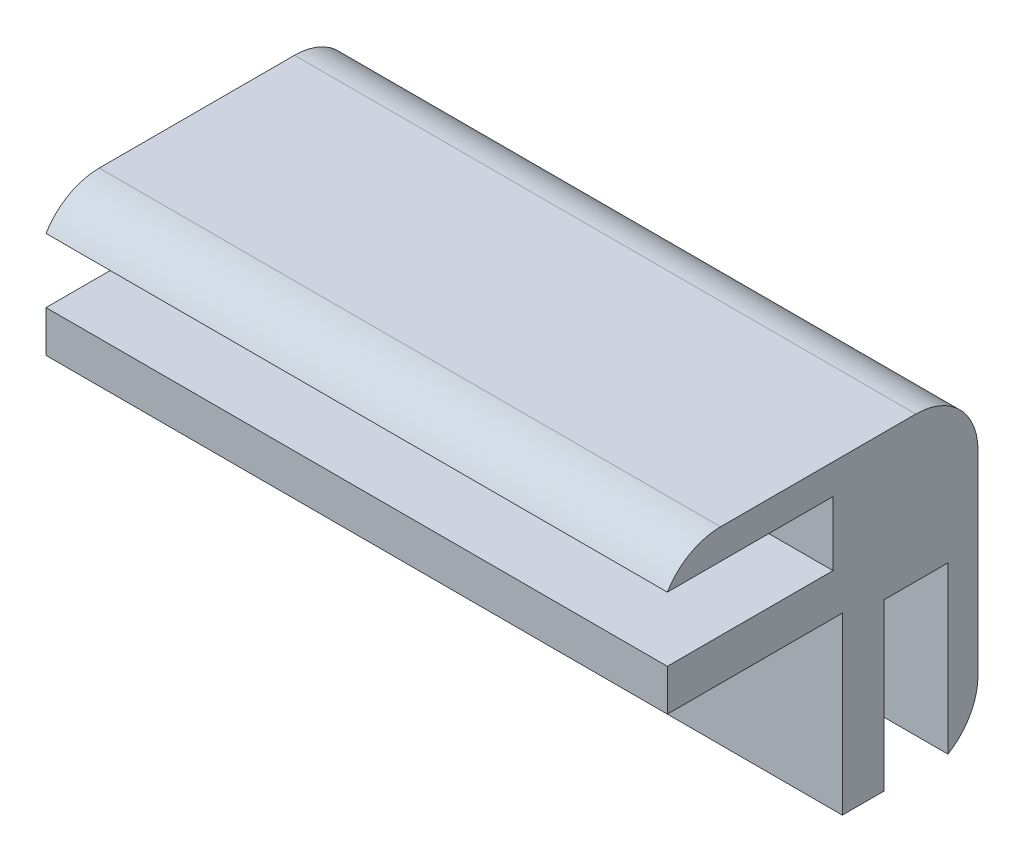
ISO-10303-21;
HEADER;
FILE_DESCRIPTION(('STEP AP214'),'2;1');
FILE_NAME('part.step','',(''),(''),'','','');
FILE_SCHEMA(('AUTOMOTIVE_DESIGN { 1 0 10303 214 1 1 1 1 }'));
ENDSEC;
DATA;
#1=APPLICATION_CONTEXT('core data for automotive mechanical design processes');
#2=APPLICATION_PROTOCOL_DEFINITION('international standard','automotive_design',2000,#1);
#3=PRODUCT_CONTEXT('',#1,'mechanical');
#4=PRODUCT('Part','Part','',(#3));
#5=PRODUCT_RELATED_PRODUCT_CATEGORY('part','',(#4));
#6=PRODUCT_DEFINITION_FORMATION('','',#4);
#7=PRODUCT_DEFINITION_CONTEXT('part definition',#1,'design');
#8=PRODUCT_DEFINITION('design','',#6,#7);
#9=PRODUCT_DEFINITION_SHAPE('','',#8);
#10=(LENGTH_UNIT() NAMED_UNIT(*) SI_UNIT(.MILLI.,.METRE.));
#11=(NAMED_UNIT(*) PLANE_ANGLE_UNIT() SI_UNIT($,.RADIAN.));
#12=(NAMED_UNIT(*) SI_UNIT($,.STERADIAN.) SOLID_ANGLE_UNIT());
#13=UNCERTAINTY_MEASURE_WITH_UNIT(LENGTH_MEASURE(1.E-05),#10,'distance_accuracy_value','');
#14=(GEOMETRIC_REPRESENTATION_CONTEXT(3) GLOBAL_UNCERTAINTY_ASSIGNED_CONTEXT((#13)) GLOBAL_UNIT_ASSIGNED_CONTEXT((#10,
#11,#12)) REPRESENTATION_CONTEXT('',''));
#15=CARTESIAN_POINT('',(0.,0.,0.));
#16=DIRECTION('',(0.,0.,1.));
#17=DIRECTION('',(1.,0.,0.));
#18=AXIS2_PLACEMENT_3D('',#15,#16,#17);
#19=CARTESIAN_POINT('',(-4.2361111111111,15.,-7.77777777777778));
#20=DIRECTION('',(-1.,0.,0.));
#21=DIRECTION('',(0.,0.,1.));
#22=AXIS2_PLACEMENT_3D('',#19,#20,#21);
#23=PLANE('',#22);
#24=DIRECTION('',(0.,0.,-1.));
#25=VECTOR('',#24,1.);
#26=CARTESIAN_POINT('',(-4.2361111111111,15.,-7.77777777777778));
#27=LINE('',#26,#25);
#28=CARTESIAN_POINT('',(-4.2361111111111,15.,4.65366231441396));
#29=VERTEX_POINT('',#28);
#30=CARTESIAN_POINT('',(-4.2361111111111,15.,-4.77777777777778));
#31=VERTEX_POINT('',#30);
#32=EDGE_CURVE('E227',#29,#31,#27,.T.);
#33=ORIENTED_EDGE('',*,*,#32,.F.);
#34=CARTESIAN_POINT('',(-4.2361111111111,12.,4.65366231441396));
#35=DIRECTION('',(-1.,0.,0.));
#36=DIRECTION('',(0.,0.,1.));
#37=AXIS2_PLACEMENT_3D('',#34,#35,#36);
#38=CIRCLE('',#37,3.);
#39=CARTESIAN_POINT('',(-4.2361111111111,13.55,7.22222222222222));
#40=VERTEX_POINT('',#39);
#41=EDGE_CURVE('E256',#29,#40,#38,.F.);
#42=ORIENTED_EDGE('',*,*,#41,.T.);
#43=DIRECTION('',(0.,0.,-1.));
#44=VECTOR('',#43,1.);
#45=CARTESIAN_POINT('',(-4.2361111111111,13.55,7.22222222222222));
#46=LINE('',#45,#44);
#47=CARTESIAN_POINT('',(-4.2361111111111,13.55,-0.777777777777776));
#48=VERTEX_POINT('',#47);
#49=EDGE_CURVE('E191',#40,#48,#46,.T.);
#50=ORIENTED_EDGE('',*,*,#49,.T.);
#51=DIRECTION('',(0.,-1.,0.));
#52=VECTOR('',#51,1.);
#53=CARTESIAN_POINT('',(-4.2361111111111,13.55,-0.777777777777776));
#54=LINE('',#53,#52);
#55=CARTESIAN_POINT('',(-4.2361111111111,10.45,-0.777777777777776));
#56=VERTEX_POINT('',#55);
#57=EDGE_CURVE('E198',#48,#56,#54,.T.);
#58=ORIENTED_EDGE('',*,*,#57,.T.);
#59=DIRECTION('',(0.,0.,-1.));
#60=VECTOR('',#59,1.);
#61=CARTESIAN_POINT('',(-4.2361111111111,10.45,7.22222222222222));
#62=LINE('',#61,#60);
#63=CARTESIAN_POINT('',(-4.2361111111111,10.45,7.22222222222222));
#64=VERTEX_POINT('',#63);
#65=EDGE_CURVE('E180',#64,#56,#62,.T.);
#66=ORIENTED_EDGE('',*,*,#65,.F.);
#67=DIRECTION('',(0.,-1.,0.));
#68=VECTOR('',#67,1.);
#69=CARTESIAN_POINT('',(-4.2361111111111,15.,7.22222222222222));
#70=LINE('',#69,#68);
#71=CARTESIAN_POINT('',(-4.2361111111111,8.45,7.22222222222222));
#72=VERTEX_POINT('',#71);
#73=EDGE_CURVE('E168',#64,#72,#70,.T.);
#74=ORIENTED_EDGE('',*,*,#73,.T.);
#75=DIRECTION('',(0.,0.,-1.));
#76=VECTOR('',#75,1.);
#77=CARTESIAN_POINT('',(-4.2361111111111,8.45,7.22222222222222));
#78=LINE('',#77,#76);
#79=CARTESIAN_POINT('',(-4.2361111111111,8.45,-1.22777777777777));
#80=VERTEX_POINT('',#79);
#81=EDGE_CURVE('E148',#72,#80,#78,.T.);
#82=ORIENTED_EDGE('',*,*,#81,.T.);
#83=DIRECTION('',(0.,-1.,0.));
#84=VECTOR('',#83,1.);
#85=CARTESIAN_POINT('',(-4.2361111111111,0.,-1.22777777777777));
#86=LINE('',#85,#84);
#87=CARTESIAN_POINT('',(-4.2361111111111,0.,-1.22777777777777));
#88=VERTEX_POINT('',#87);
#89=EDGE_CURVE('E158',#80,#88,#86,.T.);
#90=ORIENTED_EDGE('',*,*,#89,.T.);
#91=DIRECTION('',(0.,0.,-1.));
#92=VECTOR('',#91,1.);
#93=CARTESIAN_POINT('',(-4.2361111111111,0.,-7.77777777777778));
#94=LINE('',#93,#92);
#95=CARTESIAN_POINT('',(-4.2361111111111,0.,-3.22777777777777));
#96=VERTEX_POINT('',#95);
#97=EDGE_CURVE('E226',#88,#96,#94,.T.);
#98=ORIENTED_EDGE('',*,*,#97,.T.);
#99=DIRECTION('',(0.,-1.,0.));
#100=VECTOR('',#99,1.);
#101=CARTESIAN_POINT('',(-4.2361111111111,8.,-3.22777777777777));
#102=LINE('',#101,#100);
#103=CARTESIAN_POINT('',(-4.2361111111111,8.,-3.22777777777777));
#104=VERTEX_POINT('',#103);
#105=EDGE_CURVE('E201',#104,#96,#102,.T.);
#106=ORIENTED_EDGE('',*,*,#105,.F.);
#107=DIRECTION('',(0.,0.,1.));
#108=VECTOR('',#107,1.);
#109=CARTESIAN_POINT('',(-4.2361111111111,8.,-6.32777777777777));
#110=LINE('',#109,#108);
#111=CARTESIAN_POINT('',(-4.2361111111111,8.,-6.32777777777777));
#112=VERTEX_POINT('',#111);
#113=EDGE_CURVE('E221',#112,#104,#110,.T.);
#114=ORIENTED_EDGE('',*,*,#113,.F.);
#115=DIRECTION('',(0.,-1.,0.));
#116=VECTOR('',#115,1.);
#117=CARTESIAN_POINT('',(-4.2361111111111,8.,-6.32777777777777));
#118=LINE('',#117,#116);
#119=CARTESIAN_POINT('',(-4.2361111111111,0.,-6.32777777777777));
#120=VERTEX_POINT('',#119);
#121=EDGE_CURVE('E211',#112,#120,#118,.T.);
#122=ORIENTED_EDGE('',*,*,#121,.T.);
#123=CARTESIAN_POINT('',(-4.2361111111111,2.56855990780826,-4.77777777777778));
#124=DIRECTION('',(-1.,0.,0.));
#125=DIRECTION('',(0.,0.,1.));
#126=AXIS2_PLACEMENT_3D('',#123,#124,#125);
#127=CIRCLE('',#126,3.);
#128=CARTESIAN_POINT('',(-4.2361111111111,2.56855990780826,-7.77777777777778));
#129=VERTEX_POINT('',#128);
#130=EDGE_CURVE('E252',#120,#129,#127,.F.);
#131=ORIENTED_EDGE('',*,*,#130,.T.);
#132=DIRECTION('',(0.,-1.,0.));
#133=VECTOR('',#132,1.);
#134=CARTESIAN_POINT('',(-4.2361111111111,15.,-7.77777777777778));
#135=LINE('',#134,#133);
#136=CARTESIAN_POINT('',(-4.2361111111111,12.,-7.77777777777778));
#137=VERTEX_POINT('',#136);
#138=EDGE_CURVE('E243',#137,#129,#135,.T.);
#139=ORIENTED_EDGE('',*,*,#138,.F.);
#140=CARTESIAN_POINT('',(-4.2361111111111,12.,-4.77777777777778));
#141=DIRECTION('',(-1.,0.,0.));
#142=DIRECTION('',(0.,0.,1.));
#143=AXIS2_PLACEMENT_3D('',#140,#141,#142);
#144=CIRCLE('',#143,3.);
#145=EDGE_CURVE('E254',#137,#31,#144,.F.);
#146=ORIENTED_EDGE('',*,*,#145,.T.);
#147=EDGE_LOOP('',(#33,#42,#50,#58,#66,#74,#82,#90,#98,#106,#114,#122,#131,#139,#146));
#148=FACE_BOUND('',#147,.T.);
#149=ADVANCED_FACE('F37',(#148),#23,.F.);
#150=CARTESIAN_POINT('',(-34.2361111111111,15.,-7.77777777777778));
#151=DIRECTION('',(1.,0.,0.));
#152=DIRECTION('',(0.,0.,-1.));
#153=AXIS2_PLACEMENT_3D('',#150,#151,#152);
#154=PLANE('',#153);
#155=DIRECTION('',(0.,0.,1.));
#156=VECTOR('',#155,1.);
#157=CARTESIAN_POINT('',(-34.2361111111111,13.55,7.22222222222222));
#158=LINE('',#157,#156);
#159=CARTESIAN_POINT('',(-34.2361111111111,13.55,-0.777777777777776));
#160=VERTEX_POINT('',#159);
#161=CARTESIAN_POINT('',(-34.2361111111111,13.55,7.22222222222222));
#162=VERTEX_POINT('',#161);
#163=EDGE_CURVE('E185',#160,#162,#158,.T.);
#164=ORIENTED_EDGE('',*,*,#163,.T.);
#165=CARTESIAN_POINT('',(-34.2361111111111,12.,4.65366231441396));
#166=DIRECTION('',(1.,0.,0.));
#167=DIRECTION('',(0.,0.,-1.));
#168=AXIS2_PLACEMENT_3D('',#165,#166,#167);
#169=CIRCLE('',#168,3.);
#170=CARTESIAN_POINT('',(-34.2361111111111,15.,4.65366231441396));
#171=VERTEX_POINT('',#170);
#172=EDGE_CURVE('E260',#162,#171,#169,.F.);
#173=ORIENTED_EDGE('',*,*,#172,.T.);
#174=DIRECTION('',(0.,0.,1.));
#175=VECTOR('',#174,1.);
#176=CARTESIAN_POINT('',(-34.2361111111111,15.,-7.77777777777778));
#177=LINE('',#176,#175);
#178=CARTESIAN_POINT('',(-34.2361111111111,15.,-4.77777777777778));
#179=VERTEX_POINT('',#178);
#180=EDGE_CURVE('E230',#179,#171,#177,.T.);
#181=ORIENTED_EDGE('',*,*,#180,.F.);
#182=CARTESIAN_POINT('',(-34.2361111111111,12.,-4.77777777777778));
#183=DIRECTION('',(1.,0.,0.));
#184=DIRECTION('',(0.,0.,-1.));
#185=AXIS2_PLACEMENT_3D('',#182,#183,#184);
#186=CIRCLE('',#185,3.);
#187=CARTESIAN_POINT('',(-34.2361111111111,12.,-7.77777777777778));
#188=VERTEX_POINT('',#187);
#189=EDGE_CURVE('E60',#179,#188,#186,.F.);
#190=ORIENTED_EDGE('',*,*,#189,.T.);
#191=DIRECTION('',(0.,-1.,0.));
#192=VECTOR('',#191,1.);
#193=CARTESIAN_POINT('',(-34.2361111111111,15.,-7.77777777777778));
#194=LINE('',#193,#192);
#195=CARTESIAN_POINT('',(-34.2361111111111,2.56855990780826,-7.77777777777778));
#196=VERTEX_POINT('',#195);
#197=EDGE_CURVE('E241',#188,#196,#194,.T.);
#198=ORIENTED_EDGE('',*,*,#197,.T.);
#199=CARTESIAN_POINT('',(-34.2361111111111,2.56855990780826,-4.77777777777778));
#200=DIRECTION('',(1.,0.,0.));
#201=DIRECTION('',(0.,0.,-1.));
#202=AXIS2_PLACEMENT_3D('',#199,#200,#201);
#203=CIRCLE('',#202,3.);
#204=CARTESIAN_POINT('',(-34.2361111111111,0.,-6.32777777777777));
#205=VERTEX_POINT('',#204);
#206=EDGE_CURVE('E52',#196,#205,#203,.F.);
#207=ORIENTED_EDGE('',*,*,#206,.T.);
#208=DIRECTION('',(0.,1.,0.));
#209=VECTOR('',#208,1.);
#210=CARTESIAN_POINT('',(-34.2361111111111,8.,-6.32777777777777));
#211=LINE('',#210,#209);
#212=CARTESIAN_POINT('',(-34.2361111111111,8.,-6.32777777777777));
#213=VERTEX_POINT('',#212);
#214=EDGE_CURVE('E216',#205,#213,#211,.T.);
#215=ORIENTED_EDGE('',*,*,#214,.T.);
#216=DIRECTION('',(0.,0.,1.));
#217=VECTOR('',#216,1.);
#218=CARTESIAN_POINT('',(-34.2361111111111,8.,-6.32777777777777));
#219=LINE('',#218,#217);
#220=CARTESIAN_POINT('',(-34.2361111111111,8.,-3.22777777777777));
#221=VERTEX_POINT('',#220);
#222=EDGE_CURVE('E223',#213,#221,#219,.T.);
#223=ORIENTED_EDGE('',*,*,#222,.T.);
#224=DIRECTION('',(0.,1.,0.));
#225=VECTOR('',#224,1.);
#226=CARTESIAN_POINT('',(-34.2361111111111,8.,-3.22777777777777));
#227=LINE('',#226,#225);
#228=CARTESIAN_POINT('',(-34.2361111111111,0.,-3.22777777777777));
#229=VERTEX_POINT('',#228);
#230=EDGE_CURVE('E206',#229,#221,#227,.T.);
#231=ORIENTED_EDGE('',*,*,#230,.F.);
#232=DIRECTION('',(0.,0.,1.));
#233=VECTOR('',#232,1.);
#234=CARTESIAN_POINT('',(-34.2361111111111,0.,-7.77777777777778));
#235=LINE('',#234,#233);
#236=CARTESIAN_POINT('',(-34.2361111111111,0.,-1.22777777777777));
#237=VERTEX_POINT('',#236);
#238=EDGE_CURVE('E231',#229,#237,#235,.T.);
#239=ORIENTED_EDGE('',*,*,#238,.T.);
#240=DIRECTION('',(0.,-1.,0.));
#241=VECTOR('',#240,1.);
#242=CARTESIAN_POINT('',(-34.2361111111111,0.,-1.22777777777777));
#243=LINE('',#242,#241);
#244=CARTESIAN_POINT('',(-34.2361111111111,8.45,-1.22777777777777));
#245=VERTEX_POINT('',#244);
#246=EDGE_CURVE('E169',#245,#237,#243,.T.);
#247=ORIENTED_EDGE('',*,*,#246,.F.);
#248=DIRECTION('',(0.,0.,-1.));
#249=VECTOR('',#248,1.);
#250=CARTESIAN_POINT('',(-34.2361111111111,8.45,7.22222222222222));
#251=LINE('',#250,#249);
#252=CARTESIAN_POINT('',(-34.2361111111111,8.45,7.22222222222222));
#253=VERTEX_POINT('',#252);
#254=EDGE_CURVE('E151',#253,#245,#251,.T.);
#255=ORIENTED_EDGE('',*,*,#254,.F.);
#256=DIRECTION('',(0.,-1.,0.));
#257=VECTOR('',#256,1.);
#258=CARTESIAN_POINT('',(-34.2361111111111,15.,7.22222222222222));
#259=LINE('',#258,#257);
#260=CARTESIAN_POINT('',(-34.2361111111111,10.45,7.22222222222222));
#261=VERTEX_POINT('',#260);
#262=EDGE_CURVE('E238',#261,#253,#259,.T.);
#263=ORIENTED_EDGE('',*,*,#262,.F.);
#264=DIRECTION('',(0.,0.,1.));
#265=VECTOR('',#264,1.);
#266=CARTESIAN_POINT('',(-34.2361111111111,10.45,7.22222222222222));
#267=LINE('',#266,#265);
#268=CARTESIAN_POINT('',(-34.2361111111111,10.45,-0.777777777777776));
#269=VERTEX_POINT('',#268);
#270=EDGE_CURVE('E174',#269,#261,#267,.T.);
#271=ORIENTED_EDGE('',*,*,#270,.F.);
#272=DIRECTION('',(0.,-1.,0.));
#273=VECTOR('',#272,1.);
#274=CARTESIAN_POINT('',(-34.2361111111111,13.55,-0.777777777777776));
#275=LINE('',#274,#273);
#276=EDGE_CURVE('E196',#160,#269,#275,.T.);
#277=ORIENTED_EDGE('',*,*,#276,.F.);
#278=EDGE_LOOP('',(#164,#173,#181,#190,#198,#207,#215,#223,#231,#239,#247,#255,#263,#271,#277));
#279=FACE_BOUND('',#278,.T.);
#280=ADVANCED_FACE('F266',(#279),#154,.F.);
#281=CARTESIAN_POINT('',(0.,0.,0.));
#282=DIRECTION('',(0.,1.,0.));
#283=DIRECTION('',(0.,0.,1.));
#284=AXIS2_PLACEMENT_3D('',#281,#282,#283);
#285=PLANE('',#284);
#286=ORIENTED_EDGE('',*,*,#97,.F.);
#287=DIRECTION('',(-1.,0.,0.));
#288=VECTOR('',#287,1.);
#289=CARTESIAN_POINT('',(-4.2361111111111,0.,-1.22777777777777));
#290=LINE('',#289,#288);
#291=EDGE_CURVE('E154',#88,#237,#290,.T.);
#292=ORIENTED_EDGE('',*,*,#291,.T.);
#293=ORIENTED_EDGE('',*,*,#238,.F.);
#294=DIRECTION('',(-1.,0.,0.));
#295=VECTOR('',#294,1.);
#296=CARTESIAN_POINT('',(-4.2361111111111,0.,-3.22777777777777));
#297=LINE('',#296,#295);
#298=EDGE_CURVE('E204',#96,#229,#297,.T.);
#299=ORIENTED_EDGE('',*,*,#298,.F.);
#300=EDGE_LOOP('',(#286,#292,#293,#299));
#301=FACE_BOUND('',#300,.T.);
#302=ADVANCED_FACE('F284',(#301),#285,.F.);
#303=CARTESIAN_POINT('',(-34.2361111111111,15.,-7.77777777777778));
#304=DIRECTION('',(0.,0.,1.));
#305=DIRECTION('',(1.,0.,0.));
#306=AXIS2_PLACEMENT_3D('',#303,#304,#305);
#307=PLANE('',#306);
#308=ORIENTED_EDGE('',*,*,#197,.F.);
#309=DIRECTION('',(-1.,0.,0.));
#310=VECTOR('',#309,1.);
#311=CARTESIAN_POINT('',(-4.2361111111111,12.,-7.77777777777778));
#312=LINE('',#311,#310);
#313=EDGE_CURVE('E11',#188,#137,#312,.F.);
#314=ORIENTED_EDGE('',*,*,#313,.T.);
#315=ORIENTED_EDGE('',*,*,#138,.T.);
#316=DIRECTION('',(-1.,0.,0.));
#317=VECTOR('',#316,1.);
#318=CARTESIAN_POINT('',(-34.2361111111111,2.56855990780826,-7.77777777777778));
#319=LINE('',#318,#317);
#320=EDGE_CURVE('E45',#129,#196,#319,.T.);
#321=ORIENTED_EDGE('',*,*,#320,.T.);
#322=EDGE_LOOP('',(#308,#314,#315,#321));
#323=FACE_BOUND('',#322,.T.);
#324=ADVANCED_FACE('F262',(#323),#307,.F.);
#325=CARTESIAN_POINT('',(-34.2361111111111,15.,7.22222222222222));
#326=DIRECTION('',(0.,0.,-1.));
#327=DIRECTION('',(-1.,0.,0.));
#328=AXIS2_PLACEMENT_3D('',#325,#326,#327);
#329=PLANE('',#328);
#330=ORIENTED_EDGE('',*,*,#262,.T.);
#331=DIRECTION('',(-1.,0.,0.));
#332=VECTOR('',#331,1.);
#333=CARTESIAN_POINT('',(-4.2361111111111,8.45,7.22222222222222));
#334=LINE('',#333,#332);
#335=EDGE_CURVE('E155',#72,#253,#334,.T.);
#336=ORIENTED_EDGE('',*,*,#335,.F.);
#337=ORIENTED_EDGE('',*,*,#73,.F.);
#338=DIRECTION('',(1.,0.,0.));
#339=VECTOR('',#338,1.);
#340=CARTESIAN_POINT('',(-34.2361111111111,10.45,7.22222222222222));
#341=LINE('',#340,#339);
#342=EDGE_CURVE('E178',#261,#64,#341,.T.);
#343=ORIENTED_EDGE('',*,*,#342,.F.);
#344=EDGE_LOOP('',(#330,#336,#337,#343));
#345=FACE_BOUND('',#344,.T.);
#346=ADVANCED_FACE('F291',(#345),#329,.F.);
#347=CARTESIAN_POINT('',(0.,15.,0.));
#348=DIRECTION('',(0.,1.,0.));
#349=DIRECTION('',(0.,0.,1.));
#350=AXIS2_PLACEMENT_3D('',#347,#348,#349);
#351=PLANE('',#350);
#352=ORIENTED_EDGE('',*,*,#180,.T.);
#353=DIRECTION('',(1.,0.,0.));
#354=VECTOR('',#353,1.);
#355=CARTESIAN_POINT('',(-4.2361111111111,15.,4.65366231441396));
#356=LINE('',#355,#354);
#357=EDGE_CURVE('E249',#171,#29,#356,.T.);
#358=ORIENTED_EDGE('',*,*,#357,.T.);
#359=ORIENTED_EDGE('',*,*,#32,.T.);
#360=DIRECTION('',(-1.,0.,0.));
#361=VECTOR('',#360,1.);
#362=CARTESIAN_POINT('',(-34.2361111111111,15.,-4.77777777777778));
#363=LINE('',#362,#361);
#364=EDGE_CURVE('E246',#31,#179,#363,.T.);
#365=ORIENTED_EDGE('',*,*,#364,.T.);
#366=EDGE_LOOP('',(#352,#358,#359,#365));
#367=FACE_BOUND('',#366,.T.);
#368=ADVANCED_FACE('F312',(#367),#351,.T.);
#369=CARTESIAN_POINT('',(-4.2361111111111,8.,-6.32777777777777));
#370=DIRECTION('',(0.,-1.,0.));
#371=DIRECTION('',(0.,0.,-1.));
#372=AXIS2_PLACEMENT_3D('',#369,#370,#371);
#373=PLANE('',#372);
#374=ORIENTED_EDGE('',*,*,#222,.F.);
#375=DIRECTION('',(1.,0.,0.));
#376=VECTOR('',#375,1.);
#377=CARTESIAN_POINT('',(-4.2361111111111,8.,-6.32777777777777));
#378=LINE('',#377,#376);
#379=EDGE_CURVE('E219',#213,#112,#378,.T.);
#380=ORIENTED_EDGE('',*,*,#379,.T.);
#381=ORIENTED_EDGE('',*,*,#113,.T.);
#382=DIRECTION('',(1.,0.,0.));
#383=VECTOR('',#382,1.);
#384=CARTESIAN_POINT('',(-4.2361111111111,8.,-3.22777777777777));
#385=LINE('',#384,#383);
#386=EDGE_CURVE('E208',#221,#104,#385,.T.);
#387=ORIENTED_EDGE('',*,*,#386,.F.);
#388=EDGE_LOOP('',(#374,#380,#381,#387));
#389=FACE_BOUND('',#388,.T.);
#390=ADVANCED_FACE('F277',(#389),#373,.T.);
#391=CARTESIAN_POINT('',(0.,0.,-6.32777777777777));
#392=DIRECTION('',(0.,0.,-1.));
#393=DIRECTION('',(-1.,0.,0.));
#394=AXIS2_PLACEMENT_3D('',#391,#392,#393);
#395=PLANE('',#394);
#396=ORIENTED_EDGE('',*,*,#121,.F.);
#397=ORIENTED_EDGE('',*,*,#379,.F.);
#398=ORIENTED_EDGE('',*,*,#214,.F.);
#399=DIRECTION('',(-1.,0.,0.));
#400=VECTOR('',#399,1.);
#401=CARTESIAN_POINT('',(-4.2361111111111,0.,-6.32777777777777));
#402=LINE('',#401,#400);
#403=EDGE_CURVE('E214',#120,#205,#402,.T.);
#404=ORIENTED_EDGE('',*,*,#403,.F.);
#405=EDGE_LOOP('',(#396,#397,#398,#404));
#406=FACE_BOUND('',#405,.T.);
#407=ADVANCED_FACE('F271',(#406),#395,.F.);
#408=CARTESIAN_POINT('',(0.,0.,-3.22777777777777));
#409=DIRECTION('',(0.,0.,-1.));
#410=DIRECTION('',(-1.,0.,0.));
#411=AXIS2_PLACEMENT_3D('',#408,#409,#410);
#412=PLANE('',#411);
#413=ORIENTED_EDGE('',*,*,#105,.T.);
#414=ORIENTED_EDGE('',*,*,#298,.T.);
#415=ORIENTED_EDGE('',*,*,#230,.T.);
#416=ORIENTED_EDGE('',*,*,#386,.T.);
#417=EDGE_LOOP('',(#413,#414,#415,#416));
#418=FACE_BOUND('',#417,.T.);
#419=ADVANCED_FACE('F279',(#418),#412,.T.);
#420=CARTESIAN_POINT('',(-34.2361111111111,13.55,-0.777777777777776));
#421=DIRECTION('',(0.,0.,1.));
#422=DIRECTION('',(1.,0.,0.));
#423=AXIS2_PLACEMENT_3D('',#420,#421,#422);
#424=PLANE('',#423);
#425=ORIENTED_EDGE('',*,*,#57,.F.);
#426=DIRECTION('',(-1.,0.,0.));
#427=VECTOR('',#426,1.);
#428=CARTESIAN_POINT('',(-34.2361111111111,13.55,-0.777777777777776));
#429=LINE('',#428,#427);
#430=EDGE_CURVE('E194',#48,#160,#429,.T.);
#431=ORIENTED_EDGE('',*,*,#430,.T.);
#432=ORIENTED_EDGE('',*,*,#276,.T.);
#433=DIRECTION('',(-1.,0.,0.));
#434=VECTOR('',#433,1.);
#435=CARTESIAN_POINT('',(-34.2361111111111,10.45,-0.777777777777776));
#436=LINE('',#435,#434);
#437=EDGE_CURVE('E182',#56,#269,#436,.T.);
#438=ORIENTED_EDGE('',*,*,#437,.F.);
#439=EDGE_LOOP('',(#425,#431,#432,#438));
#440=FACE_BOUND('',#439,.T.);
#441=ADVANCED_FACE('F322',(#440),#424,.T.);
#442=CARTESIAN_POINT('',(0.,13.55,0.));
#443=DIRECTION('',(0.,-1.,0.));
#444=DIRECTION('',(0.,0.,-1.));
#445=AXIS2_PLACEMENT_3D('',#442,#443,#444);
#446=PLANE('',#445);
#447=ORIENTED_EDGE('',*,*,#163,.F.);
#448=ORIENTED_EDGE('',*,*,#430,.F.);
#449=ORIENTED_EDGE('',*,*,#49,.F.);
#450=DIRECTION('',(1.,0.,0.));
#451=VECTOR('',#450,1.);
#452=CARTESIAN_POINT('',(-34.2361111111111,13.55,7.22222222222222));
#453=LINE('',#452,#451);
#454=EDGE_CURVE('E188',#162,#40,#453,.T.);
#455=ORIENTED_EDGE('',*,*,#454,.F.);
#456=EDGE_LOOP('',(#447,#448,#449,#455));
#457=FACE_BOUND('',#456,.T.);
#458=ADVANCED_FACE('F319',(#457),#446,.T.);
#459=CARTESIAN_POINT('',(0.,10.45,0.));
#460=DIRECTION('',(0.,-1.,0.));
#461=DIRECTION('',(0.,0.,-1.));
#462=AXIS2_PLACEMENT_3D('',#459,#460,#461);
#463=PLANE('',#462);
#464=ORIENTED_EDGE('',*,*,#270,.T.);
#465=ORIENTED_EDGE('',*,*,#342,.T.);
#466=ORIENTED_EDGE('',*,*,#65,.T.);
#467=ORIENTED_EDGE('',*,*,#437,.T.);
#468=EDGE_LOOP('',(#464,#465,#466,#467));
#469=FACE_BOUND('',#468,.T.);
#470=ADVANCED_FACE('F329',(#469),#463,.F.);
#471=CARTESIAN_POINT('',(-4.2361111111111,0.,-1.22777777777777));
#472=DIRECTION('',(0.,0.,-1.));
#473=DIRECTION('',(-1.,0.,0.));
#474=AXIS2_PLACEMENT_3D('',#471,#472,#473);
#475=PLANE('',#474);
#476=ORIENTED_EDGE('',*,*,#246,.T.);
#477=ORIENTED_EDGE('',*,*,#291,.F.);
#478=ORIENTED_EDGE('',*,*,#89,.F.);
#479=DIRECTION('',(-1.,0.,0.));
#480=VECTOR('',#479,1.);
#481=CARTESIAN_POINT('',(-4.2361111111111,8.45,-1.22777777777777));
#482=LINE('',#481,#480);
#483=EDGE_CURVE('E144',#80,#245,#482,.T.);
#484=ORIENTED_EDGE('',*,*,#483,.T.);
#485=EDGE_LOOP('',(#476,#477,#478,#484));
#486=FACE_BOUND('',#485,.T.);
#487=ADVANCED_FACE('F159',(#486),#475,.F.);
#488=CARTESIAN_POINT('',(-4.2361111111111,8.45,7.22222222222222));
#489=DIRECTION('',(0.,1.,0.));
#490=DIRECTION('',(0.,0.,1.));
#491=AXIS2_PLACEMENT_3D('',#488,#489,#490);
#492=PLANE('',#491);
#493=ORIENTED_EDGE('',*,*,#254,.T.);
#494=ORIENTED_EDGE('',*,*,#483,.F.);
#495=ORIENTED_EDGE('',*,*,#81,.F.);
#496=ORIENTED_EDGE('',*,*,#335,.T.);
#497=EDGE_LOOP('',(#493,#494,#495,#496));
#498=FACE_BOUND('',#497,.T.);
#499=ADVANCED_FACE('F146',(#498),#492,.F.);
#500=CARTESIAN_POINT('',(-34.2361111111111,12.,4.65366231441396));
#501=DIRECTION('',(-1.,0.,0.));
#502=DIRECTION('',(0.,0.,1.));
#503=AXIS2_PLACEMENT_3D('',#500,#501,#502);
#504=CYLINDRICAL_SURFACE('',#503,3.);
#505=ORIENTED_EDGE('',*,*,#172,.F.);
#506=ORIENTED_EDGE('',*,*,#454,.T.);
#507=ORIENTED_EDGE('',*,*,#41,.F.);
#508=ORIENTED_EDGE('',*,*,#357,.F.);
#509=EDGE_LOOP('',(#505,#506,#507,#508));
#510=FACE_BOUND('',#509,.T.);
#511=ADVANCED_FACE('F301',(#510),#504,.T.);
#512=CARTESIAN_POINT('',(0.,12.,-4.77777777777778));
#513=DIRECTION('',(1.,0.,0.));
#514=DIRECTION('',(0.,0.,-1.));
#515=AXIS2_PLACEMENT_3D('',#512,#513,#514);
#516=CYLINDRICAL_SURFACE('',#515,3.);
#517=ORIENTED_EDGE('',*,*,#145,.F.);
#518=ORIENTED_EDGE('',*,*,#313,.F.);
#519=ORIENTED_EDGE('',*,*,#189,.F.);
#520=ORIENTED_EDGE('',*,*,#364,.F.);
#521=EDGE_LOOP('',(#517,#518,#519,#520));
#522=FACE_BOUND('',#521,.T.);
#523=ADVANCED_FACE('F303',(#522),#516,.T.);
#524=CARTESIAN_POINT('',(0.,2.56855990780826,-4.77777777777778));
#525=DIRECTION('',(-1.,0.,0.));
#526=DIRECTION('',(0.,0.,1.));
#527=AXIS2_PLACEMENT_3D('',#524,#525,#526);
#528=CYLINDRICAL_SURFACE('',#527,3.);
#529=ORIENTED_EDGE('',*,*,#130,.F.);
#530=ORIENTED_EDGE('',*,*,#403,.T.);
#531=ORIENTED_EDGE('',*,*,#206,.F.);
#532=ORIENTED_EDGE('',*,*,#320,.F.);
#533=EDGE_LOOP('',(#529,#530,#531,#532));
#534=FACE_BOUND('',#533,.T.);
#535=ADVANCED_FACE('F39',(#534),#528,.T.);
#536=CLOSED_SHELL('',(#149,#280,#302,#324,#346,#368,#390,#407,#419,#441,#458,#470,#487,#499,
#511,#523,#535));
#537=MANIFOLD_SOLID_BREP('B2',#536);
#538=ADVANCED_BREP_SHAPE_REPRESENTATION('',(#18,#537),#14);
#539=SHAPE_DEFINITION_REPRESENTATION(#9,#538);
ENDSEC;
END-ISO-10303-21;
